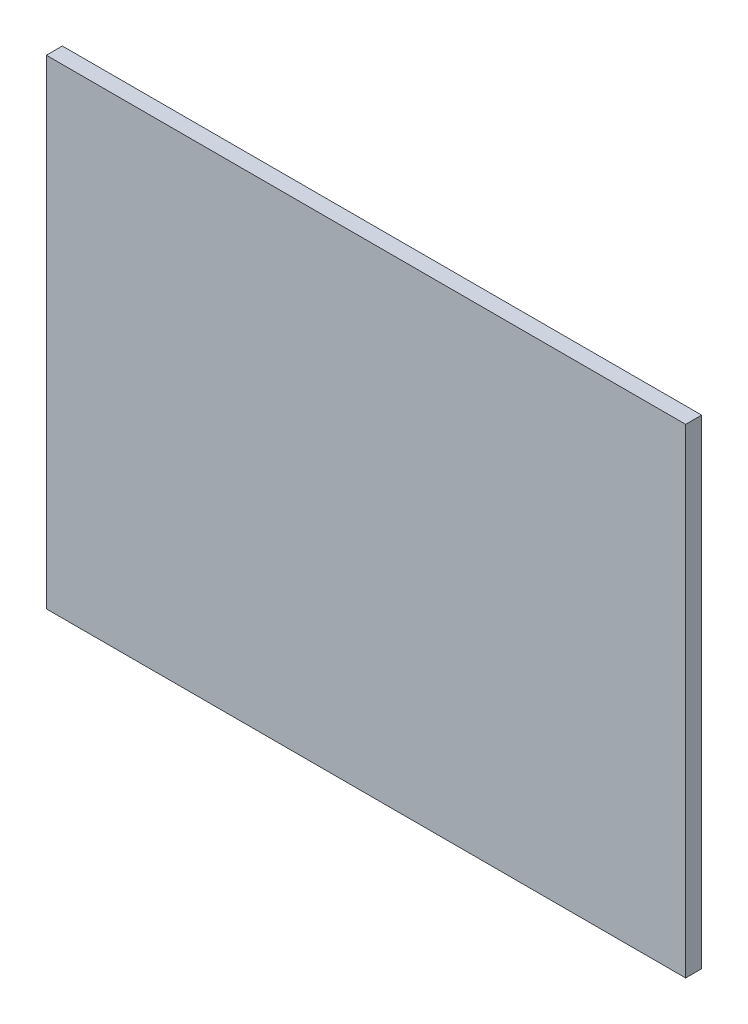
ISO-10303-21;
HEADER;
FILE_DESCRIPTION(('STEP AP214'),'2;1');
FILE_NAME('part.step','',(''),(''),'','','');
FILE_SCHEMA(('AUTOMOTIVE_DESIGN { 1 0 10303 214 1 1 1 1 }'));
ENDSEC;
DATA;
#1=APPLICATION_CONTEXT('core data for automotive mechanical design processes');
#2=APPLICATION_PROTOCOL_DEFINITION('international standard','automotive_design',2000,#1);
#3=PRODUCT_CONTEXT('',#1,'mechanical');
#4=PRODUCT('Part','Part','',(#3));
#5=PRODUCT_RELATED_PRODUCT_CATEGORY('part','',(#4));
#6=PRODUCT_DEFINITION_FORMATION('','',#4);
#7=PRODUCT_DEFINITION_CONTEXT('part definition',#1,'design');
#8=PRODUCT_DEFINITION('design','',#6,#7);
#9=PRODUCT_DEFINITION_SHAPE('','',#8);
#10=(LENGTH_UNIT() NAMED_UNIT(*) SI_UNIT(.MILLI.,.METRE.));
#11=(NAMED_UNIT(*) PLANE_ANGLE_UNIT() SI_UNIT($,.RADIAN.));
#12=(NAMED_UNIT(*) SI_UNIT($,.STERADIAN.) SOLID_ANGLE_UNIT());
#13=UNCERTAINTY_MEASURE_WITH_UNIT(LENGTH_MEASURE(1.E-05),#10,'distance_accuracy_value','');
#14=(GEOMETRIC_REPRESENTATION_CONTEXT(3) GLOBAL_UNCERTAINTY_ASSIGNED_CONTEXT((#13)) GLOBAL_UNIT_ASSIGNED_CONTEXT((#10,
#11,#12)) REPRESENTATION_CONTEXT('',''));
#15=CARTESIAN_POINT('',(0.,0.,0.));
#16=DIRECTION('',(0.,0.,1.));
#17=DIRECTION('',(1.,0.,0.));
#18=AXIS2_PLACEMENT_3D('',#15,#16,#17);
#19=CARTESIAN_POINT('',(40.,-30.,2.));
#20=DIRECTION('',(-1.,0.,0.));
#21=DIRECTION('',(0.,0.,1.));
#22=AXIS2_PLACEMENT_3D('',#19,#20,#21);
#23=PLANE('',#22);
#24=DIRECTION('',(0.,1.,0.));
#25=VECTOR('',#24,1.);
#26=CARTESIAN_POINT('',(40.,-30.,0.));
#27=LINE('',#26,#25);
#28=CARTESIAN_POINT('',(40.,-30.,0.));
#29=VERTEX_POINT('',#28);
#30=CARTESIAN_POINT('',(40.,30.,0.));
#31=VERTEX_POINT('',#30);
#32=EDGE_CURVE('E98',#29,#31,#27,.T.);
#33=ORIENTED_EDGE('',*,*,#32,.T.);
#34=DIRECTION('',(0.,0.,-1.));
#35=VECTOR('',#34,1.);
#36=CARTESIAN_POINT('',(40.,30.,2.));
#37=LINE('',#36,#35);
#38=CARTESIAN_POINT('',(40.,30.,2.));
#39=VERTEX_POINT('',#38);
#40=EDGE_CURVE('E11',#39,#31,#37,.T.);
#41=ORIENTED_EDGE('',*,*,#40,.F.);
#42=DIRECTION('',(0.,1.,0.));
#43=VECTOR('',#42,1.);
#44=CARTESIAN_POINT('',(40.,-30.,2.));
#45=LINE('',#44,#43);
#46=CARTESIAN_POINT('',(40.,-30.,2.));
#47=VERTEX_POINT('',#46);
#48=EDGE_CURVE('E86',#47,#39,#45,.T.);
#49=ORIENTED_EDGE('',*,*,#48,.F.);
#50=DIRECTION('',(0.,0.,-1.));
#51=VECTOR('',#50,1.);
#52=CARTESIAN_POINT('',(40.,-30.,2.));
#53=LINE('',#52,#51);
#54=EDGE_CURVE('E94',#47,#29,#53,.T.);
#55=ORIENTED_EDGE('',*,*,#54,.T.);
#56=EDGE_LOOP('',(#33,#41,#49,#55));
#57=FACE_BOUND('',#56,.T.);
#58=ADVANCED_FACE('F35',(#57),#23,.F.);
#59=CARTESIAN_POINT('',(-40.,30.,2.));
#60=DIRECTION('',(0.,-1.,0.));
#61=DIRECTION('',(0.,0.,-1.));
#62=AXIS2_PLACEMENT_3D('',#59,#60,#61);
#63=PLANE('',#62);
#64=DIRECTION('',(-1.,0.,0.));
#65=VECTOR('',#64,1.);
#66=CARTESIAN_POINT('',(-40.,30.,0.));
#67=LINE('',#66,#65);
#68=CARTESIAN_POINT('',(-40.,30.,0.));
#69=VERTEX_POINT('',#68);
#70=EDGE_CURVE('E90',#31,#69,#67,.T.);
#71=ORIENTED_EDGE('',*,*,#70,.T.);
#72=DIRECTION('',(0.,0.,-1.));
#73=VECTOR('',#72,1.);
#74=CARTESIAN_POINT('',(-40.,30.,2.));
#75=LINE('',#74,#73);
#76=CARTESIAN_POINT('',(-40.,30.,2.));
#77=VERTEX_POINT('',#76);
#78=EDGE_CURVE('E43',#77,#69,#75,.T.);
#79=ORIENTED_EDGE('',*,*,#78,.F.);
#80=DIRECTION('',(-1.,0.,0.));
#81=VECTOR('',#80,1.);
#82=CARTESIAN_POINT('',(-40.,30.,2.));
#83=LINE('',#82,#81);
#84=EDGE_CURVE('E81',#39,#77,#83,.T.);
#85=ORIENTED_EDGE('',*,*,#84,.F.);
#86=ORIENTED_EDGE('',*,*,#40,.T.);
#87=EDGE_LOOP('',(#71,#79,#85,#86));
#88=FACE_BOUND('',#87,.T.);
#89=ADVANCED_FACE('F89',(#88),#63,.F.);
#90=CARTESIAN_POINT('',(-40.,-30.,2.));
#91=DIRECTION('',(1.,0.,0.));
#92=DIRECTION('',(0.,0.,-1.));
#93=AXIS2_PLACEMENT_3D('',#90,#91,#92);
#94=PLANE('',#93);
#95=DIRECTION('',(0.,-1.,0.));
#96=VECTOR('',#95,1.);
#97=CARTESIAN_POINT('',(-40.,-30.,0.));
#98=LINE('',#97,#96);
#99=CARTESIAN_POINT('',(-40.,-30.,0.));
#100=VERTEX_POINT('',#99);
#101=EDGE_CURVE('E68',#69,#100,#98,.T.);
#102=ORIENTED_EDGE('',*,*,#101,.T.);
#103=DIRECTION('',(0.,0.,-1.));
#104=VECTOR('',#103,1.);
#105=CARTESIAN_POINT('',(-40.,-30.,2.));
#106=LINE('',#105,#104);
#107=CARTESIAN_POINT('',(-40.,-30.,2.));
#108=VERTEX_POINT('',#107);
#109=EDGE_CURVE('E91',#108,#100,#106,.T.);
#110=ORIENTED_EDGE('',*,*,#109,.F.);
#111=DIRECTION('',(0.,-1.,0.));
#112=VECTOR('',#111,1.);
#113=CARTESIAN_POINT('',(-40.,-30.,2.));
#114=LINE('',#113,#112);
#115=EDGE_CURVE('E84',#77,#108,#114,.T.);
#116=ORIENTED_EDGE('',*,*,#115,.F.);
#117=ORIENTED_EDGE('',*,*,#78,.T.);
#118=EDGE_LOOP('',(#102,#110,#116,#117));
#119=FACE_BOUND('',#118,.T.);
#120=ADVANCED_FACE('F92',(#119),#94,.F.);
#121=CARTESIAN_POINT('',(-40.,-30.,2.));
#122=DIRECTION('',(0.,1.,0.));
#123=DIRECTION('',(0.,0.,1.));
#124=AXIS2_PLACEMENT_3D('',#121,#122,#123);
#125=PLANE('',#124);
#126=DIRECTION('',(1.,0.,0.));
#127=VECTOR('',#126,1.);
#128=CARTESIAN_POINT('',(-40.,-30.,0.));
#129=LINE('',#128,#127);
#130=EDGE_CURVE('E74',#100,#29,#129,.T.);
#131=ORIENTED_EDGE('',*,*,#130,.T.);
#132=ORIENTED_EDGE('',*,*,#54,.F.);
#133=DIRECTION('',(1.,0.,0.));
#134=VECTOR('',#133,1.);
#135=CARTESIAN_POINT('',(-40.,-30.,2.));
#136=LINE('',#135,#134);
#137=EDGE_CURVE('E51',#108,#47,#136,.T.);
#138=ORIENTED_EDGE('',*,*,#137,.F.);
#139=ORIENTED_EDGE('',*,*,#109,.T.);
#140=EDGE_LOOP('',(#131,#132,#138,#139));
#141=FACE_BOUND('',#140,.T.);
#142=ADVANCED_FACE('F106',(#141),#125,.F.);
#143=CARTESIAN_POINT('',(0.,0.,2.));
#144=DIRECTION('',(0.,0.,-1.));
#145=DIRECTION('',(-1.,0.,0.));
#146=AXIS2_PLACEMENT_3D('',#143,#144,#145);
#147=PLANE('',#146);
#148=ORIENTED_EDGE('',*,*,#48,.T.);
#149=ORIENTED_EDGE('',*,*,#84,.T.);
#150=ORIENTED_EDGE('',*,*,#115,.T.);
#151=ORIENTED_EDGE('',*,*,#137,.T.);
#152=EDGE_LOOP('',(#148,#149,#150,#151));
#153=FACE_BOUND('',#152,.T.);
#154=ADVANCED_FACE('F82',(#153),#147,.F.);
#155=CARTESIAN_POINT('',(0.,0.,0.));
#156=DIRECTION('',(0.,0.,-1.));
#157=DIRECTION('',(-1.,0.,0.));
#158=AXIS2_PLACEMENT_3D('',#155,#156,#157);
#159=PLANE('',#158);
#160=ORIENTED_EDGE('',*,*,#32,.F.);
#161=ORIENTED_EDGE('',*,*,#130,.F.);
#162=ORIENTED_EDGE('',*,*,#101,.F.);
#163=ORIENTED_EDGE('',*,*,#70,.F.);
#164=EDGE_LOOP('',(#160,#161,#162,#163));
#165=FACE_BOUND('',#164,.T.);
#166=ADVANCED_FACE('F109',(#165),#159,.T.);
#167=CLOSED_SHELL('',(#58,#89,#120,#142,#154,#166));
#168=MANIFOLD_SOLID_BREP('B2',#167);
#169=ADVANCED_BREP_SHAPE_REPRESENTATION('',(#18,#168),#14);
#170=SHAPE_DEFINITION_REPRESENTATION(#9,#169);
ENDSEC;
END-ISO-10303-21;
